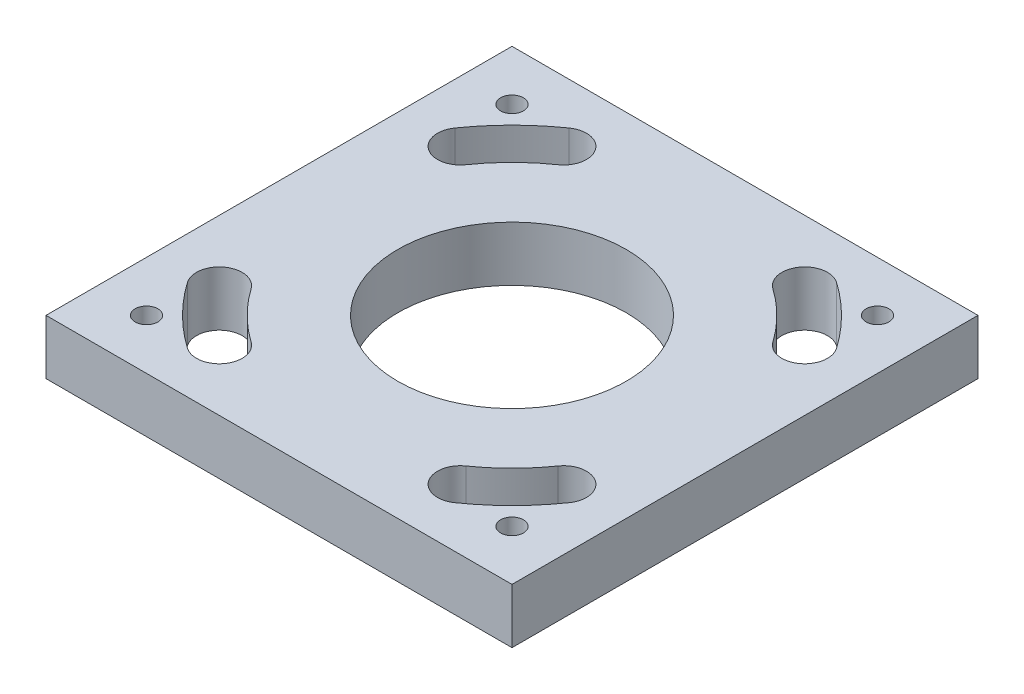
ISO-10303-21;
HEADER;
FILE_DESCRIPTION(('STEP AP214'),'2;1');
FILE_NAME('part.step','',(''),(''),'','','');
FILE_SCHEMA(('AUTOMOTIVE_DESIGN { 1 0 10303 214 1 1 1 1 }'));
ENDSEC;
DATA;
#1=APPLICATION_CONTEXT('core data for automotive mechanical design processes');
#2=APPLICATION_PROTOCOL_DEFINITION('international standard','automotive_design',2000,#1);
#3=PRODUCT_CONTEXT('',#1,'mechanical');
#4=PRODUCT('Part','Part','',(#3));
#5=PRODUCT_RELATED_PRODUCT_CATEGORY('part','',(#4));
#6=PRODUCT_DEFINITION_FORMATION('','',#4);
#7=PRODUCT_DEFINITION_CONTEXT('part definition',#1,'design');
#8=PRODUCT_DEFINITION('design','',#6,#7);
#9=PRODUCT_DEFINITION_SHAPE('','',#8);
#10=(LENGTH_UNIT() NAMED_UNIT(*) SI_UNIT(.MILLI.,.METRE.));
#11=(NAMED_UNIT(*) PLANE_ANGLE_UNIT() SI_UNIT($,.RADIAN.));
#12=(NAMED_UNIT(*) SI_UNIT($,.STERADIAN.) SOLID_ANGLE_UNIT());
#13=UNCERTAINTY_MEASURE_WITH_UNIT(LENGTH_MEASURE(1.E-05),#10,'distance_accuracy_value','');
#14=(GEOMETRIC_REPRESENTATION_CONTEXT(3) GLOBAL_UNCERTAINTY_ASSIGNED_CONTEXT((#13)) GLOBAL_UNIT_ASSIGNED_CONTEXT((#10,
#11,#12)) REPRESENTATION_CONTEXT('',''));
#15=CARTESIAN_POINT('',(0.,0.,0.));
#16=DIRECTION('',(0.,0.,1.));
#17=DIRECTION('',(1.,0.,0.));
#18=AXIS2_PLACEMENT_3D('',#15,#16,#17);
#19=CARTESIAN_POINT('',(0.,0.,0.));
#20=DIRECTION('',(0.,-1.,0.));
#21=DIRECTION('',(0.,0.,-1.));
#22=AXIS2_PLACEMENT_3D('',#19,#20,#21);
#23=PLANE('',#22);
#24=CARTESIAN_POINT('',(-63.5,0.,-63.5));
#25=DIRECTION('',(0.,1.,0.));
#26=DIRECTION('',(0.,0.,1.));
#27=AXIS2_PLACEMENT_3D('',#24,#25,#26);
#28=CIRCLE('',#27,3.96874999999999);
#29=CARTESIAN_POINT('',(-63.5,0.,-59.53125));
#30=VERTEX_POINT('',#29);
#31=EDGE_CURVE('E529',#30,#30,#28,.T.);
#32=ORIENTED_EDGE('',*,*,#31,.F.);
#33=EDGE_LOOP('',(#32));
#34=FACE_BOUND('',#33,.T.);
#35=CARTESIAN_POINT('',(63.5,0.,-63.5));
#36=DIRECTION('',(0.,1.,0.));
#37=DIRECTION('',(0.,0.,1.));
#38=AXIS2_PLACEMENT_3D('',#35,#36,#37);
#39=CIRCLE('',#38,3.96874999999999);
#40=CARTESIAN_POINT('',(63.5,0.,-59.53125));
#41=VERTEX_POINT('',#40);
#42=EDGE_CURVE('E533',#41,#41,#39,.T.);
#43=ORIENTED_EDGE('',*,*,#42,.F.);
#44=EDGE_LOOP('',(#43));
#45=FACE_BOUND('',#44,.T.);
#46=CARTESIAN_POINT('',(-63.5,0.,63.5));
#47=DIRECTION('',(0.,1.,0.));
#48=DIRECTION('',(0.,0.,1.));
#49=AXIS2_PLACEMENT_3D('',#46,#47,#48);
#50=CIRCLE('',#49,3.96874999999999);
#51=CARTESIAN_POINT('',(-63.5,0.,67.46875));
#52=VERTEX_POINT('',#51);
#53=EDGE_CURVE('E543',#52,#52,#50,.T.);
#54=ORIENTED_EDGE('',*,*,#53,.F.);
#55=EDGE_LOOP('',(#54));
#56=FACE_BOUND('',#55,.T.);
#57=CARTESIAN_POINT('',(0.,0.,0.));
#58=DIRECTION('',(0.,1.,0.));
#59=DIRECTION('',(0.,0.,1.));
#60=AXIS2_PLACEMENT_3D('',#57,#58,#59);
#61=CIRCLE('',#60,80.9625);
#62=CARTESIAN_POINT('',(-66.3205973857478,0.,46.438182228071));
#63=VERTEX_POINT('',#62);
#64=CARTESIAN_POINT('',(-46.4381822280725,0.,66.3205973857469));
#65=VERTEX_POINT('',#64);
#66=EDGE_CURVE('E217',#63,#65,#61,.T.);
#67=ORIENTED_EDGE('',*,*,#66,.F.);
#68=CARTESIAN_POINT('',(-59.818578034204,0.,41.8854192645347));
#69=DIRECTION('',(0.,1.,0.));
#70=DIRECTION('',(0.,0.,1.));
#71=AXIS2_PLACEMENT_3D('',#68,#69,#70);
#72=CIRCLE('',#71,7.93749999999999);
#73=CARTESIAN_POINT('',(-53.3165586826601,0.,37.3326563009983));
#74=VERTEX_POINT('',#73);
#75=EDGE_CURVE('E67',#74,#63,#72,.T.);
#76=ORIENTED_EDGE('',*,*,#75,.F.);
#77=CARTESIAN_POINT('',(0.,0.,0.));
#78=DIRECTION('',(0.,-1.,0.));
#79=DIRECTION('',(0.,0.,1.));
#80=AXIS2_PLACEMENT_3D('',#77,#78,#79);
#81=CIRCLE('',#80,65.0875);
#82=CARTESIAN_POINT('',(-37.3326563009994,0.,53.3165586826593));
#83=VERTEX_POINT('',#82);
#84=EDGE_CURVE('E201',#83,#74,#81,.T.);
#85=ORIENTED_EDGE('',*,*,#84,.F.);
#86=CARTESIAN_POINT('',(-41.885419264536,0.,59.8185780342031));
#87=DIRECTION('',(0.,1.,0.));
#88=DIRECTION('',(0.,0.,1.));
#89=AXIS2_PLACEMENT_3D('',#86,#87,#88);
#90=CIRCLE('',#89,7.93749999999999);
#91=EDGE_CURVE('E205',#65,#83,#90,.T.);
#92=ORIENTED_EDGE('',*,*,#91,.F.);
#93=EDGE_LOOP('',(#67,#76,#85,#92));
#94=FACE_BOUND('',#93,.T.);
#95=CARTESIAN_POINT('',(0.,0.,0.));
#96=DIRECTION('',(0.,1.,0.));
#97=DIRECTION('',(0.,0.,1.));
#98=AXIS2_PLACEMENT_3D('',#95,#96,#97);
#99=CIRCLE('',#98,80.9625);
#100=CARTESIAN_POINT('',(46.4381822280713,0.,66.3205973857477));
#101=VERTEX_POINT('',#100);
#102=CARTESIAN_POINT('',(66.320597385747,0.,46.4381822280722));
#103=VERTEX_POINT('',#102);
#104=EDGE_CURVE('E252',#101,#103,#99,.T.);
#105=ORIENTED_EDGE('',*,*,#104,.F.);
#106=CARTESIAN_POINT('',(41.8854192645349,0.,59.8185780342038));
#107=DIRECTION('',(0.,1.,0.));
#108=DIRECTION('',(0.,0.,1.));
#109=AXIS2_PLACEMENT_3D('',#106,#107,#108);
#110=CIRCLE('',#109,7.93749999999998);
#111=CARTESIAN_POINT('',(37.3326563009985,0.,53.3165586826599));
#112=VERTEX_POINT('',#111);
#113=EDGE_CURVE('E226',#112,#101,#110,.T.);
#114=ORIENTED_EDGE('',*,*,#113,.F.);
#115=CARTESIAN_POINT('',(0.,0.,0.));
#116=DIRECTION('',(0.,-1.,0.));
#117=DIRECTION('',(0.,0.,1.));
#118=AXIS2_PLACEMENT_3D('',#115,#116,#117);
#119=CIRCLE('',#118,65.0875);
#120=CARTESIAN_POINT('',(53.3165586826594,0.,37.3326563009992));
#121=VERTEX_POINT('',#120);
#122=EDGE_CURVE('E237',#121,#112,#119,.T.);
#123=ORIENTED_EDGE('',*,*,#122,.F.);
#124=CARTESIAN_POINT('',(59.8185780342032,0.,41.8854192645357));
#125=DIRECTION('',(0.,1.,0.));
#126=DIRECTION('',(0.,0.,1.));
#127=AXIS2_PLACEMENT_3D('',#124,#125,#126);
#128=CIRCLE('',#127,7.93749999999999);
#129=EDGE_CURVE('E256',#103,#121,#128,.T.);
#130=ORIENTED_EDGE('',*,*,#129,.F.);
#131=EDGE_LOOP('',(#105,#114,#123,#130));
#132=FACE_BOUND('',#131,.T.);
#133=CARTESIAN_POINT('',(0.,0.,0.));
#134=DIRECTION('',(0.,1.,0.));
#135=DIRECTION('',(0.,0.,1.));
#136=AXIS2_PLACEMENT_3D('',#133,#134,#135);
#137=CIRCLE('',#136,80.9625);
#138=CARTESIAN_POINT('',(66.3205973857475,0.,-46.4381822280715));
#139=VERTEX_POINT('',#138);
#140=CARTESIAN_POINT('',(46.438182228072,0.,-66.3205973857472));
#141=VERTEX_POINT('',#140);
#142=EDGE_CURVE('E296',#139,#141,#137,.T.);
#143=ORIENTED_EDGE('',*,*,#142,.F.);
#144=CARTESIAN_POINT('',(59.8185780342036,0.,-41.8854192645351));
#145=DIRECTION('',(0.,1.,0.));
#146=DIRECTION('',(0.,0.,1.));
#147=AXIS2_PLACEMENT_3D('',#144,#145,#146);
#148=CIRCLE('',#147,7.93749999999999);
#149=CARTESIAN_POINT('',(53.3165586826598,0.,-37.3326563009987));
#150=VERTEX_POINT('',#149);
#151=EDGE_CURVE('E266',#150,#139,#148,.T.);
#152=ORIENTED_EDGE('',*,*,#151,.F.);
#153=CARTESIAN_POINT('',(0.,0.,0.));
#154=DIRECTION('',(0.,-1.,0.));
#155=DIRECTION('',(0.,0.,1.));
#156=AXIS2_PLACEMENT_3D('',#153,#154,#155);
#157=CIRCLE('',#156,65.0875);
#158=CARTESIAN_POINT('',(37.3326563009991,0.,-53.3165586826595));
#159=VERTEX_POINT('',#158);
#160=EDGE_CURVE('E281',#159,#150,#157,.T.);
#161=ORIENTED_EDGE('',*,*,#160,.F.);
#162=CARTESIAN_POINT('',(41.8854192645355,0.,-59.8185780342034));
#163=DIRECTION('',(0.,1.,0.));
#164=DIRECTION('',(0.,0.,1.));
#165=AXIS2_PLACEMENT_3D('',#162,#163,#164);
#166=CIRCLE('',#165,7.93749999999998);
#167=EDGE_CURVE('E300',#141,#159,#166,.T.);
#168=ORIENTED_EDGE('',*,*,#167,.F.);
#169=EDGE_LOOP('',(#143,#152,#161,#168));
#170=FACE_BOUND('',#169,.T.);
#171=CARTESIAN_POINT('',(0.,0.,0.));
#172=DIRECTION('',(0.,1.,0.));
#173=DIRECTION('',(0.,0.,1.));
#174=AXIS2_PLACEMENT_3D('',#171,#172,#173);
#175=CIRCLE('',#174,80.9625);
#176=CARTESIAN_POINT('',(-46.4381822280717,0.,-66.3205973857474));
#177=VERTEX_POINT('',#176);
#178=CARTESIAN_POINT('',(-66.3205973857473,0.,-46.4381822280718));
#179=VERTEX_POINT('',#178);
#180=EDGE_CURVE('E340',#177,#179,#175,.T.);
#181=ORIENTED_EDGE('',*,*,#180,.F.);
#182=CARTESIAN_POINT('',(-41.8854192645353,0.,-59.8185780342035));
#183=DIRECTION('',(0.,1.,0.));
#184=DIRECTION('',(0.,0.,1.));
#185=AXIS2_PLACEMENT_3D('',#182,#183,#184);
#186=CIRCLE('',#185,7.93749999999998);
#187=CARTESIAN_POINT('',(-37.3326563009988,0.,-53.3165586826597));
#188=VERTEX_POINT('',#187);
#189=EDGE_CURVE('E310',#188,#177,#186,.T.);
#190=ORIENTED_EDGE('',*,*,#189,.F.);
#191=CARTESIAN_POINT('',(0.,0.,0.));
#192=DIRECTION('',(0.,-1.,0.));
#193=DIRECTION('',(0.,0.,1.));
#194=AXIS2_PLACEMENT_3D('',#191,#192,#193);
#195=CIRCLE('',#194,65.0875);
#196=CARTESIAN_POINT('',(-53.3165586826596,0.,-37.3326563009989));
#197=VERTEX_POINT('',#196);
#198=EDGE_CURVE('E325',#197,#188,#195,.T.);
#199=ORIENTED_EDGE('',*,*,#198,.F.);
#200=CARTESIAN_POINT('',(-59.8185780342035,0.,-41.8854192645353));
#201=DIRECTION('',(0.,1.,0.));
#202=DIRECTION('',(0.,0.,1.));
#203=AXIS2_PLACEMENT_3D('',#200,#201,#202);
#204=CIRCLE('',#203,7.93749999999999);
#205=EDGE_CURVE('E344',#179,#197,#204,.T.);
#206=ORIENTED_EDGE('',*,*,#205,.F.);
#207=EDGE_LOOP('',(#181,#190,#199,#206));
#208=FACE_BOUND('',#207,.T.);
#209=CARTESIAN_POINT('',(0.,0.,0.));
#210=DIRECTION('',(0.,1.,0.));
#211=DIRECTION('',(0.,0.,1.));
#212=AXIS2_PLACEMENT_3D('',#209,#210,#211);
#213=CIRCLE('',#212,39.6875);
#214=CARTESIAN_POINT('',(0.,0.,39.6875));
#215=VERTEX_POINT('',#214);
#216=EDGE_CURVE('E354',#215,#215,#213,.T.);
#217=ORIENTED_EDGE('',*,*,#216,.F.);
#218=EDGE_LOOP('',(#217));
#219=FACE_BOUND('',#218,.T.);
#220=DIRECTION('',(0.,0.,-1.));
#221=VECTOR('',#220,1.);
#222=CARTESIAN_POINT('',(80.9625,0.,80.9625));
#223=LINE('',#222,#221);
#224=CARTESIAN_POINT('',(80.9625,0.,80.9625));
#225=VERTEX_POINT('',#224);
#226=CARTESIAN_POINT('',(80.9625,0.,-80.9625));
#227=VERTEX_POINT('',#226);
#228=EDGE_CURVE('E368',#225,#227,#223,.T.);
#229=ORIENTED_EDGE('',*,*,#228,.T.);
#230=DIRECTION('',(-1.,0.,0.));
#231=VECTOR('',#230,1.);
#232=CARTESIAN_POINT('',(-80.9625,0.,-80.9625));
#233=LINE('',#232,#231);
#234=CARTESIAN_POINT('',(-80.9625,0.,-80.9625));
#235=VERTEX_POINT('',#234);
#236=EDGE_CURVE('E392',#227,#235,#233,.T.);
#237=ORIENTED_EDGE('',*,*,#236,.T.);
#238=DIRECTION('',(0.,0.,1.));
#239=VECTOR('',#238,1.);
#240=CARTESIAN_POINT('',(-80.9625,0.,80.9625));
#241=LINE('',#240,#239);
#242=CARTESIAN_POINT('',(-80.9625,0.,80.9625));
#243=VERTEX_POINT('',#242);
#244=EDGE_CURVE('E396',#235,#243,#241,.T.);
#245=ORIENTED_EDGE('',*,*,#244,.T.);
#246=DIRECTION('',(1.,0.,0.));
#247=VECTOR('',#246,1.);
#248=CARTESIAN_POINT('',(-80.9625,0.,80.9625));
#249=LINE('',#248,#247);
#250=EDGE_CURVE('E377',#243,#225,#249,.T.);
#251=ORIENTED_EDGE('',*,*,#250,.T.);
#252=EDGE_LOOP('',(#229,#237,#245,#251));
#253=FACE_BOUND('',#252,.T.);
#254=CARTESIAN_POINT('',(63.5,0.,63.5));
#255=DIRECTION('',(0.,1.,0.));
#256=DIRECTION('',(0.,0.,1.));
#257=AXIS2_PLACEMENT_3D('',#254,#255,#256);
#258=CIRCLE('',#257,3.96874999999999);
#259=CARTESIAN_POINT('',(63.5,0.,67.46875));
#260=VERTEX_POINT('',#259);
#261=EDGE_CURVE('E550',#260,#260,#258,.T.);
#262=ORIENTED_EDGE('',*,*,#261,.F.);
#263=EDGE_LOOP('',(#262));
#264=FACE_BOUND('',#263,.T.);
#265=ADVANCED_FACE('F41',(#34,#45,#56,#94,#132,#170,#208,#219,#253,#264),#23,.F.);
#266=CARTESIAN_POINT('',(80.9625,-19.05,80.9625));
#267=DIRECTION('',(1.,0.,0.));
#268=DIRECTION('',(0.,0.,-1.));
#269=AXIS2_PLACEMENT_3D('',#266,#267,#268);
#270=PLANE('',#269);
#271=ORIENTED_EDGE('',*,*,#228,.F.);
#272=DIRECTION('',(0.,1.,0.));
#273=VECTOR('',#272,1.);
#274=CARTESIAN_POINT('',(80.9625,-19.05,80.9625));
#275=LINE('',#274,#273);
#276=CARTESIAN_POINT('',(80.9625,-19.05,80.9625));
#277=VERTEX_POINT('',#276);
#278=EDGE_CURVE('E11',#277,#225,#275,.T.);
#279=ORIENTED_EDGE('',*,*,#278,.F.);
#280=DIRECTION('',(0.,0.,-1.));
#281=VECTOR('',#280,1.);
#282=CARTESIAN_POINT('',(80.9625,-19.05,80.9625));
#283=LINE('',#282,#281);
#284=CARTESIAN_POINT('',(80.9625,-19.05,-80.9625));
#285=VERTEX_POINT('',#284);
#286=EDGE_CURVE('E372',#277,#285,#283,.T.);
#287=ORIENTED_EDGE('',*,*,#286,.T.);
#288=DIRECTION('',(0.,1.,0.));
#289=VECTOR('',#288,1.);
#290=CARTESIAN_POINT('',(80.9625,-19.05,-80.9625));
#291=LINE('',#290,#289);
#292=EDGE_CURVE('E45',#285,#227,#291,.T.);
#293=ORIENTED_EDGE('',*,*,#292,.T.);
#294=EDGE_LOOP('',(#271,#279,#287,#293));
#295=FACE_BOUND('',#294,.T.);
#296=ADVANCED_FACE('F43',(#295),#270,.T.);
#297=CARTESIAN_POINT('',(-80.9625,-19.05,80.9625));
#298=DIRECTION('',(0.,0.,1.));
#299=DIRECTION('',(1.,0.,0.));
#300=AXIS2_PLACEMENT_3D('',#297,#298,#299);
#301=PLANE('',#300);
#302=ORIENTED_EDGE('',*,*,#250,.F.);
#303=DIRECTION('',(0.,1.,0.));
#304=VECTOR('',#303,1.);
#305=CARTESIAN_POINT('',(-80.9625,-19.05,80.9625));
#306=LINE('',#305,#304);
#307=CARTESIAN_POINT('',(-80.9625,-19.05,80.9625));
#308=VERTEX_POINT('',#307);
#309=EDGE_CURVE('E51',#308,#243,#306,.T.);
#310=ORIENTED_EDGE('',*,*,#309,.F.);
#311=DIRECTION('',(1.,0.,0.));
#312=VECTOR('',#311,1.);
#313=CARTESIAN_POINT('',(-80.9625,-19.05,80.9625));
#314=LINE('',#313,#312);
#315=EDGE_CURVE('E385',#308,#277,#314,.T.);
#316=ORIENTED_EDGE('',*,*,#315,.T.);
#317=ORIENTED_EDGE('',*,*,#278,.T.);
#318=EDGE_LOOP('',(#302,#310,#316,#317));
#319=FACE_BOUND('',#318,.T.);
#320=ADVANCED_FACE('F419',(#319),#301,.T.);
#321=CARTESIAN_POINT('',(-80.9625,-19.05,80.9625));
#322=DIRECTION('',(-1.,0.,0.));
#323=DIRECTION('',(0.,0.,1.));
#324=AXIS2_PLACEMENT_3D('',#321,#322,#323);
#325=PLANE('',#324);
#326=ORIENTED_EDGE('',*,*,#244,.F.);
#327=DIRECTION('',(0.,1.,0.));
#328=VECTOR('',#327,1.);
#329=CARTESIAN_POINT('',(-80.9625,-19.05,-80.9625));
#330=LINE('',#329,#328);
#331=CARTESIAN_POINT('',(-80.9625,-19.05,-80.9625));
#332=VERTEX_POINT('',#331);
#333=EDGE_CURVE('E404',#332,#235,#330,.T.);
#334=ORIENTED_EDGE('',*,*,#333,.F.);
#335=DIRECTION('',(0.,0.,1.));
#336=VECTOR('',#335,1.);
#337=CARTESIAN_POINT('',(-80.9625,-19.05,80.9625));
#338=LINE('',#337,#336);
#339=EDGE_CURVE('E381',#332,#308,#338,.T.);
#340=ORIENTED_EDGE('',*,*,#339,.T.);
#341=ORIENTED_EDGE('',*,*,#309,.T.);
#342=EDGE_LOOP('',(#326,#334,#340,#341));
#343=FACE_BOUND('',#342,.T.);
#344=ADVANCED_FACE('F424',(#343),#325,.T.);
#345=CARTESIAN_POINT('',(-80.9625,-19.05,-80.9625));
#346=DIRECTION('',(0.,0.,-1.));
#347=DIRECTION('',(-1.,0.,0.));
#348=AXIS2_PLACEMENT_3D('',#345,#346,#347);
#349=PLANE('',#348);
#350=ORIENTED_EDGE('',*,*,#236,.F.);
#351=ORIENTED_EDGE('',*,*,#292,.F.);
#352=DIRECTION('',(-1.,0.,0.));
#353=VECTOR('',#352,1.);
#354=CARTESIAN_POINT('',(-80.9625,-19.05,-80.9625));
#355=LINE('',#354,#353);
#356=EDGE_CURVE('E376',#285,#332,#355,.T.);
#357=ORIENTED_EDGE('',*,*,#356,.T.);
#358=ORIENTED_EDGE('',*,*,#333,.T.);
#359=EDGE_LOOP('',(#350,#351,#357,#358));
#360=FACE_BOUND('',#359,.T.);
#361=ADVANCED_FACE('F414',(#360),#349,.T.);
#362=CARTESIAN_POINT('',(0.,-19.05,0.));
#363=DIRECTION('',(0.,-1.,0.));
#364=DIRECTION('',(0.,0.,-1.));
#365=AXIS2_PLACEMENT_3D('',#362,#363,#364);
#366=PLANE('',#365);
#367=CARTESIAN_POINT('',(-63.5,-19.05,-63.5));
#368=DIRECTION('',(0.,1.,0.));
#369=DIRECTION('',(0.,0.,1.));
#370=AXIS2_PLACEMENT_3D('',#367,#368,#369);
#371=CIRCLE('',#370,3.96875);
#372=CARTESIAN_POINT('',(-63.5,-19.05,-59.53125));
#373=VERTEX_POINT('',#372);
#374=EDGE_CURVE('E527',#373,#373,#371,.T.);
#375=ORIENTED_EDGE('',*,*,#374,.T.);
#376=EDGE_LOOP('',(#375));
#377=FACE_BOUND('',#376,.T.);
#378=CARTESIAN_POINT('',(63.5,-19.05,-63.5));
#379=DIRECTION('',(0.,1.,0.));
#380=DIRECTION('',(0.,0.,1.));
#381=AXIS2_PLACEMENT_3D('',#378,#379,#380);
#382=CIRCLE('',#381,3.96874999999999);
#383=CARTESIAN_POINT('',(63.5,-19.05,-59.53125));
#384=VERTEX_POINT('',#383);
#385=EDGE_CURVE('E539',#384,#384,#382,.T.);
#386=ORIENTED_EDGE('',*,*,#385,.T.);
#387=EDGE_LOOP('',(#386));
#388=FACE_BOUND('',#387,.T.);
#389=CARTESIAN_POINT('',(-63.5,-19.05,63.5));
#390=DIRECTION('',(0.,1.,0.));
#391=DIRECTION('',(0.,0.,1.));
#392=AXIS2_PLACEMENT_3D('',#389,#390,#391);
#393=CIRCLE('',#392,3.96875);
#394=CARTESIAN_POINT('',(-63.5,-19.05,67.46875));
#395=VERTEX_POINT('',#394);
#396=EDGE_CURVE('E547',#395,#395,#393,.T.);
#397=ORIENTED_EDGE('',*,*,#396,.T.);
#398=EDGE_LOOP('',(#397));
#399=FACE_BOUND('',#398,.T.);
#400=CARTESIAN_POINT('',(63.5,-19.05,63.5));
#401=DIRECTION('',(0.,1.,0.));
#402=DIRECTION('',(0.,0.,1.));
#403=AXIS2_PLACEMENT_3D('',#400,#401,#402);
#404=CIRCLE('',#403,3.96874999999999);
#405=CARTESIAN_POINT('',(63.5,-19.05,67.46875));
#406=VERTEX_POINT('',#405);
#407=EDGE_CURVE('E208',#406,#406,#404,.T.);
#408=ORIENTED_EDGE('',*,*,#407,.T.);
#409=EDGE_LOOP('',(#408));
#410=FACE_BOUND('',#409,.T.);
#411=CARTESIAN_POINT('',(-59.818578034204,-19.05,41.8854192645347));
#412=DIRECTION('',(0.,1.,0.));
#413=DIRECTION('',(0.,0.,1.));
#414=AXIS2_PLACEMENT_3D('',#411,#412,#413);
#415=CIRCLE('',#414,7.93749999999999);
#416=CARTESIAN_POINT('',(-53.3165586826601,-19.05,37.3326563009983));
#417=VERTEX_POINT('',#416);
#418=CARTESIAN_POINT('',(-66.3205973857478,-19.05,46.438182228071));
#419=VERTEX_POINT('',#418);
#420=EDGE_CURVE('E182',#417,#419,#415,.T.);
#421=ORIENTED_EDGE('',*,*,#420,.T.);
#422=CARTESIAN_POINT('',(0.,-19.05,0.));
#423=DIRECTION('',(0.,1.,0.));
#424=DIRECTION('',(0.,0.,1.));
#425=AXIS2_PLACEMENT_3D('',#422,#423,#424);
#426=CIRCLE('',#425,80.9625);
#427=CARTESIAN_POINT('',(-46.4381822280725,-19.05,66.3205973857469));
#428=VERTEX_POINT('',#427);
#429=EDGE_CURVE('E192',#419,#428,#426,.T.);
#430=ORIENTED_EDGE('',*,*,#429,.T.);
#431=CARTESIAN_POINT('',(-41.885419264536,-19.05,59.8185780342031));
#432=DIRECTION('',(0.,1.,0.));
#433=DIRECTION('',(0.,0.,1.));
#434=AXIS2_PLACEMENT_3D('',#431,#432,#433);
#435=CIRCLE('',#434,7.93749999999999);
#436=CARTESIAN_POINT('',(-37.3326563009994,-19.05,53.3165586826593));
#437=VERTEX_POINT('',#436);
#438=EDGE_CURVE('E59',#428,#437,#435,.T.);
#439=ORIENTED_EDGE('',*,*,#438,.T.);
#440=CARTESIAN_POINT('',(0.,-19.05,0.));
#441=DIRECTION('',(0.,-1.,0.));
#442=DIRECTION('',(0.,0.,1.));
#443=AXIS2_PLACEMENT_3D('',#440,#441,#442);
#444=CIRCLE('',#443,65.0875);
#445=EDGE_CURVE('E189',#437,#417,#444,.T.);
#446=ORIENTED_EDGE('',*,*,#445,.T.);
#447=EDGE_LOOP('',(#421,#430,#439,#446));
#448=FACE_BOUND('',#447,.T.);
#449=CARTESIAN_POINT('',(41.8854192645349,-19.05,59.8185780342038));
#450=DIRECTION('',(0.,1.,0.));
#451=DIRECTION('',(0.,0.,1.));
#452=AXIS2_PLACEMENT_3D('',#449,#450,#451);
#453=CIRCLE('',#452,7.93749999999998);
#454=CARTESIAN_POINT('',(37.3326563009985,-19.05,53.3165586826599));
#455=VERTEX_POINT('',#454);
#456=CARTESIAN_POINT('',(46.4381822280713,-19.05,66.3205973857477));
#457=VERTEX_POINT('',#456);
#458=EDGE_CURVE('E232',#455,#457,#453,.T.);
#459=ORIENTED_EDGE('',*,*,#458,.T.);
#460=CARTESIAN_POINT('',(0.,-19.05,0.));
#461=DIRECTION('',(0.,1.,0.));
#462=DIRECTION('',(0.,0.,1.));
#463=AXIS2_PLACEMENT_3D('',#460,#461,#462);
#464=CIRCLE('',#463,80.9625);
#465=CARTESIAN_POINT('',(66.320597385747,-19.05,46.4381822280722));
#466=VERTEX_POINT('',#465);
#467=EDGE_CURVE('E236',#457,#466,#464,.T.);
#468=ORIENTED_EDGE('',*,*,#467,.T.);
#469=CARTESIAN_POINT('',(59.8185780342032,-19.05,41.8854192645357));
#470=DIRECTION('',(0.,1.,0.));
#471=DIRECTION('',(0.,0.,1.));
#472=AXIS2_PLACEMENT_3D('',#469,#470,#471);
#473=CIRCLE('',#472,7.93749999999999);
#474=CARTESIAN_POINT('',(53.3165586826594,-19.05,37.3326563009992));
#475=VERTEX_POINT('',#474);
#476=EDGE_CURVE('E241',#466,#475,#473,.T.);
#477=ORIENTED_EDGE('',*,*,#476,.T.);
#478=CARTESIAN_POINT('',(0.,-19.05,0.));
#479=DIRECTION('',(0.,-1.,0.));
#480=DIRECTION('',(0.,0.,1.));
#481=AXIS2_PLACEMENT_3D('',#478,#479,#480);
#482=CIRCLE('',#481,65.0875);
#483=EDGE_CURVE('E245',#475,#455,#482,.T.);
#484=ORIENTED_EDGE('',*,*,#483,.T.);
#485=EDGE_LOOP('',(#459,#468,#477,#484));
#486=FACE_BOUND('',#485,.T.);
#487=CARTESIAN_POINT('',(59.8185780342036,-19.05,-41.8854192645351));
#488=DIRECTION('',(0.,1.,0.));
#489=DIRECTION('',(0.,0.,1.));
#490=AXIS2_PLACEMENT_3D('',#487,#488,#489);
#491=CIRCLE('',#490,7.93749999999999);
#492=CARTESIAN_POINT('',(53.3165586826598,-19.05,-37.3326563009987));
#493=VERTEX_POINT('',#492);
#494=CARTESIAN_POINT('',(66.3205973857475,-19.05,-46.4381822280715));
#495=VERTEX_POINT('',#494);
#496=EDGE_CURVE('E276',#493,#495,#491,.T.);
#497=ORIENTED_EDGE('',*,*,#496,.T.);
#498=CARTESIAN_POINT('',(0.,-19.05,0.));
#499=DIRECTION('',(0.,1.,0.));
#500=DIRECTION('',(0.,0.,1.));
#501=AXIS2_PLACEMENT_3D('',#498,#499,#500);
#502=CIRCLE('',#501,80.9625);
#503=CARTESIAN_POINT('',(46.438182228072,-19.05,-66.3205973857472));
#504=VERTEX_POINT('',#503);
#505=EDGE_CURVE('E280',#495,#504,#502,.T.);
#506=ORIENTED_EDGE('',*,*,#505,.T.);
#507=CARTESIAN_POINT('',(41.8854192645355,-19.05,-59.8185780342034));
#508=DIRECTION('',(0.,1.,0.));
#509=DIRECTION('',(0.,0.,1.));
#510=AXIS2_PLACEMENT_3D('',#507,#508,#509);
#511=CIRCLE('',#510,7.93749999999998);
#512=CARTESIAN_POINT('',(37.3326563009991,-19.05,-53.3165586826595));
#513=VERTEX_POINT('',#512);
#514=EDGE_CURVE('E285',#504,#513,#511,.T.);
#515=ORIENTED_EDGE('',*,*,#514,.T.);
#516=CARTESIAN_POINT('',(0.,-19.05,0.));
#517=DIRECTION('',(0.,-1.,0.));
#518=DIRECTION('',(0.,0.,1.));
#519=AXIS2_PLACEMENT_3D('',#516,#517,#518);
#520=CIRCLE('',#519,65.0875);
#521=EDGE_CURVE('E289',#513,#493,#520,.T.);
#522=ORIENTED_EDGE('',*,*,#521,.T.);
#523=EDGE_LOOP('',(#497,#506,#515,#522));
#524=FACE_BOUND('',#523,.T.);
#525=CARTESIAN_POINT('',(-41.8854192645353,-19.05,-59.8185780342035));
#526=DIRECTION('',(0.,1.,0.));
#527=DIRECTION('',(0.,0.,1.));
#528=AXIS2_PLACEMENT_3D('',#525,#526,#527);
#529=CIRCLE('',#528,7.93749999999998);
#530=CARTESIAN_POINT('',(-37.3326563009988,-19.05,-53.3165586826597));
#531=VERTEX_POINT('',#530);
#532=CARTESIAN_POINT('',(-46.4381822280717,-19.05,-66.3205973857474));
#533=VERTEX_POINT('',#532);
#534=EDGE_CURVE('E320',#531,#533,#529,.T.);
#535=ORIENTED_EDGE('',*,*,#534,.T.);
#536=CARTESIAN_POINT('',(0.,-19.05,0.));
#537=DIRECTION('',(0.,1.,0.));
#538=DIRECTION('',(0.,0.,1.));
#539=AXIS2_PLACEMENT_3D('',#536,#537,#538);
#540=CIRCLE('',#539,80.9625);
#541=CARTESIAN_POINT('',(-66.3205973857473,-19.05,-46.4381822280718));
#542=VERTEX_POINT('',#541);
#543=EDGE_CURVE('E324',#533,#542,#540,.T.);
#544=ORIENTED_EDGE('',*,*,#543,.T.);
#545=CARTESIAN_POINT('',(-59.8185780342035,-19.05,-41.8854192645353));
#546=DIRECTION('',(0.,1.,0.));
#547=DIRECTION('',(0.,0.,1.));
#548=AXIS2_PLACEMENT_3D('',#545,#546,#547);
#549=CIRCLE('',#548,7.93749999999999);
#550=CARTESIAN_POINT('',(-53.3165586826596,-19.05,-37.3326563009989));
#551=VERTEX_POINT('',#550);
#552=EDGE_CURVE('E329',#542,#551,#549,.T.);
#553=ORIENTED_EDGE('',*,*,#552,.T.);
#554=CARTESIAN_POINT('',(0.,-19.05,0.));
#555=DIRECTION('',(0.,-1.,0.));
#556=DIRECTION('',(0.,0.,1.));
#557=AXIS2_PLACEMENT_3D('',#554,#555,#556);
#558=CIRCLE('',#557,65.0875);
#559=EDGE_CURVE('E333',#551,#531,#558,.T.);
#560=ORIENTED_EDGE('',*,*,#559,.T.);
#561=EDGE_LOOP('',(#535,#544,#553,#560));
#562=FACE_BOUND('',#561,.T.);
#563=CARTESIAN_POINT('',(0.,-19.05,0.));
#564=DIRECTION('',(0.,1.,0.));
#565=DIRECTION('',(0.,0.,1.));
#566=AXIS2_PLACEMENT_3D('',#563,#564,#565);
#567=CIRCLE('',#566,39.6875);
#568=CARTESIAN_POINT('',(0.,-19.05,39.6875));
#569=VERTEX_POINT('',#568);
#570=EDGE_CURVE('E364',#569,#569,#567,.T.);
#571=ORIENTED_EDGE('',*,*,#570,.T.);
#572=EDGE_LOOP('',(#571));
#573=FACE_BOUND('',#572,.T.);
#574=ORIENTED_EDGE('',*,*,#286,.F.);
#575=ORIENTED_EDGE('',*,*,#315,.F.);
#576=ORIENTED_EDGE('',*,*,#339,.F.);
#577=ORIENTED_EDGE('',*,*,#356,.F.);
#578=EDGE_LOOP('',(#574,#575,#576,#577));
#579=FACE_BOUND('',#578,.T.);
#580=ADVANCED_FACE('F197',(#377,#388,#399,#410,#448,#486,#524,#562,#573,#579),#366,.T.);
#581=CARTESIAN_POINT('',(0.,-19.05,0.));
#582=DIRECTION('',(0.,1.,0.));
#583=DIRECTION('',(0.,0.,1.));
#584=AXIS2_PLACEMENT_3D('',#581,#582,#583);
#585=CYLINDRICAL_SURFACE('',#584,39.6875);
#586=ORIENTED_EDGE('',*,*,#570,.F.);
#587=EDGE_LOOP('',(#586));
#588=FACE_BOUND('',#587,.T.);
#589=ORIENTED_EDGE('',*,*,#216,.T.);
#590=EDGE_LOOP('',(#589));
#591=FACE_BOUND('',#590,.T.);
#592=ADVANCED_FACE('F443',(#588,#591),#585,.F.);
#593=CARTESIAN_POINT('',(-41.8854192645353,-19.05,-59.8185780342035));
#594=DIRECTION('',(0.,1.,0.));
#595=DIRECTION('',(0.,0.,1.));
#596=AXIS2_PLACEMENT_3D('',#593,#594,#595);
#597=CYLINDRICAL_SURFACE('',#596,7.93749999999998);
#598=ORIENTED_EDGE('',*,*,#189,.T.);
#599=DIRECTION('',(0.,1.,0.));
#600=VECTOR('',#599,1.);
#601=CARTESIAN_POINT('',(-46.4381822280717,-19.05,-66.3205973857474));
#602=LINE('',#601,#600);
#603=EDGE_CURVE('E337',#533,#177,#602,.T.);
#604=ORIENTED_EDGE('',*,*,#603,.F.);
#605=ORIENTED_EDGE('',*,*,#534,.F.);
#606=DIRECTION('',(0.,1.,0.));
#607=VECTOR('',#606,1.);
#608=CARTESIAN_POINT('',(-37.3326563009988,-19.05,-53.3165586826597));
#609=LINE('',#608,#607);
#610=EDGE_CURVE('E351',#531,#188,#609,.T.);
#611=ORIENTED_EDGE('',*,*,#610,.T.);
#612=EDGE_LOOP('',(#598,#604,#605,#611));
#613=FACE_BOUND('',#612,.T.);
#614=ADVANCED_FACE('F447',(#613),#597,.F.);
#615=CARTESIAN_POINT('',(0.,-19.05,0.));
#616=DIRECTION('',(0.,1.,0.));
#617=DIRECTION('',(0.,0.,1.));
#618=AXIS2_PLACEMENT_3D('',#615,#616,#617);
#619=CYLINDRICAL_SURFACE('',#618,65.0875);
#620=ORIENTED_EDGE('',*,*,#198,.T.);
#621=ORIENTED_EDGE('',*,*,#610,.F.);
#622=ORIENTED_EDGE('',*,*,#559,.F.);
#623=DIRECTION('',(0.,1.,0.));
#624=VECTOR('',#623,1.);
#625=CARTESIAN_POINT('',(-53.3165586826596,-19.05,-37.3326563009989));
#626=LINE('',#625,#624);
#627=EDGE_CURVE('E355',#551,#197,#626,.T.);
#628=ORIENTED_EDGE('',*,*,#627,.T.);
#629=EDGE_LOOP('',(#620,#621,#622,#628));
#630=FACE_BOUND('',#629,.T.);
#631=ADVANCED_FACE('F451',(#630),#619,.T.);
#632=CARTESIAN_POINT('',(-59.8185780342035,-19.05,-41.8854192645353));
#633=DIRECTION('',(0.,1.,0.));
#634=DIRECTION('',(0.,0.,1.));
#635=AXIS2_PLACEMENT_3D('',#632,#633,#634);
#636=CYLINDRICAL_SURFACE('',#635,7.93749999999999);
#637=ORIENTED_EDGE('',*,*,#205,.T.);
#638=ORIENTED_EDGE('',*,*,#627,.F.);
#639=ORIENTED_EDGE('',*,*,#552,.F.);
#640=DIRECTION('',(0.,1.,0.));
#641=VECTOR('',#640,1.);
#642=CARTESIAN_POINT('',(-66.3205973857473,-19.05,-46.4381822280718));
#643=LINE('',#642,#641);
#644=EDGE_CURVE('E358',#542,#179,#643,.T.);
#645=ORIENTED_EDGE('',*,*,#644,.T.);
#646=EDGE_LOOP('',(#637,#638,#639,#645));
#647=FACE_BOUND('',#646,.T.);
#648=ADVANCED_FACE('F457',(#647),#636,.F.);
#649=CARTESIAN_POINT('',(0.,-19.05,0.));
#650=DIRECTION('',(0.,1.,0.));
#651=DIRECTION('',(0.,0.,1.));
#652=AXIS2_PLACEMENT_3D('',#649,#650,#651);
#653=CYLINDRICAL_SURFACE('',#652,80.9625);
#654=ORIENTED_EDGE('',*,*,#180,.T.);
#655=ORIENTED_EDGE('',*,*,#644,.F.);
#656=ORIENTED_EDGE('',*,*,#543,.F.);
#657=ORIENTED_EDGE('',*,*,#603,.T.);
#658=EDGE_LOOP('',(#654,#655,#656,#657));
#659=FACE_BOUND('',#658,.T.);
#660=ADVANCED_FACE('F453',(#659),#653,.F.);
#661=CARTESIAN_POINT('',(59.8185780342036,-19.05,-41.8854192645351));
#662=DIRECTION('',(0.,1.,0.));
#663=DIRECTION('',(0.,0.,1.));
#664=AXIS2_PLACEMENT_3D('',#661,#662,#663);
#665=CYLINDRICAL_SURFACE('',#664,7.93749999999999);
#666=ORIENTED_EDGE('',*,*,#151,.T.);
#667=DIRECTION('',(0.,1.,0.));
#668=VECTOR('',#667,1.);
#669=CARTESIAN_POINT('',(66.3205973857475,-19.05,-46.4381822280715));
#670=LINE('',#669,#668);
#671=EDGE_CURVE('E293',#495,#139,#670,.T.);
#672=ORIENTED_EDGE('',*,*,#671,.F.);
#673=ORIENTED_EDGE('',*,*,#496,.F.);
#674=DIRECTION('',(0.,1.,0.));
#675=VECTOR('',#674,1.);
#676=CARTESIAN_POINT('',(53.3165586826598,-19.05,-37.3326563009987));
#677=LINE('',#676,#675);
#678=EDGE_CURVE('E307',#493,#150,#677,.T.);
#679=ORIENTED_EDGE('',*,*,#678,.T.);
#680=EDGE_LOOP('',(#666,#672,#673,#679));
#681=FACE_BOUND('',#680,.T.);
#682=ADVANCED_FACE('F456',(#681),#665,.F.);
#683=CARTESIAN_POINT('',(0.,-19.05,0.));
#684=DIRECTION('',(0.,1.,0.));
#685=DIRECTION('',(0.,0.,1.));
#686=AXIS2_PLACEMENT_3D('',#683,#684,#685);
#687=CYLINDRICAL_SURFACE('',#686,65.0875);
#688=ORIENTED_EDGE('',*,*,#160,.T.);
#689=ORIENTED_EDGE('',*,*,#678,.F.);
#690=ORIENTED_EDGE('',*,*,#521,.F.);
#691=DIRECTION('',(0.,1.,0.));
#692=VECTOR('',#691,1.);
#693=CARTESIAN_POINT('',(37.3326563009991,-19.05,-53.3165586826595));
#694=LINE('',#693,#692);
#695=EDGE_CURVE('E311',#513,#159,#694,.T.);
#696=ORIENTED_EDGE('',*,*,#695,.T.);
#697=EDGE_LOOP('',(#688,#689,#690,#696));
#698=FACE_BOUND('',#697,.T.);
#699=ADVANCED_FACE('F467',(#698),#687,.T.);
#700=CARTESIAN_POINT('',(41.8854192645355,-19.05,-59.8185780342034));
#701=DIRECTION('',(0.,1.,0.));
#702=DIRECTION('',(0.,0.,1.));
#703=AXIS2_PLACEMENT_3D('',#700,#701,#702);
#704=CYLINDRICAL_SURFACE('',#703,7.93749999999998);
#705=ORIENTED_EDGE('',*,*,#167,.T.);
#706=ORIENTED_EDGE('',*,*,#695,.F.);
#707=ORIENTED_EDGE('',*,*,#514,.F.);
#708=DIRECTION('',(0.,1.,0.));
#709=VECTOR('',#708,1.);
#710=CARTESIAN_POINT('',(46.438182228072,-19.05,-66.3205973857472));
#711=LINE('',#710,#709);
#712=EDGE_CURVE('E314',#504,#141,#711,.T.);
#713=ORIENTED_EDGE('',*,*,#712,.T.);
#714=EDGE_LOOP('',(#705,#706,#707,#713));
#715=FACE_BOUND('',#714,.T.);
#716=ADVANCED_FACE('F473',(#715),#704,.F.);
#717=CARTESIAN_POINT('',(0.,-19.05,0.));
#718=DIRECTION('',(0.,1.,0.));
#719=DIRECTION('',(0.,0.,1.));
#720=AXIS2_PLACEMENT_3D('',#717,#718,#719);
#721=CYLINDRICAL_SURFACE('',#720,80.9625);
#722=ORIENTED_EDGE('',*,*,#142,.T.);
#723=ORIENTED_EDGE('',*,*,#712,.F.);
#724=ORIENTED_EDGE('',*,*,#505,.F.);
#725=ORIENTED_EDGE('',*,*,#671,.T.);
#726=EDGE_LOOP('',(#722,#723,#724,#725));
#727=FACE_BOUND('',#726,.T.);
#728=ADVANCED_FACE('F469',(#727),#721,.F.);
#729=CARTESIAN_POINT('',(41.8854192645349,-19.05,59.8185780342038));
#730=DIRECTION('',(0.,1.,0.));
#731=DIRECTION('',(0.,0.,1.));
#732=AXIS2_PLACEMENT_3D('',#729,#730,#731);
#733=CYLINDRICAL_SURFACE('',#732,7.93749999999998);
#734=ORIENTED_EDGE('',*,*,#113,.T.);
#735=DIRECTION('',(0.,1.,0.));
#736=VECTOR('',#735,1.);
#737=CARTESIAN_POINT('',(46.4381822280713,-19.05,66.3205973857477));
#738=LINE('',#737,#736);
#739=EDGE_CURVE('E249',#457,#101,#738,.T.);
#740=ORIENTED_EDGE('',*,*,#739,.F.);
#741=ORIENTED_EDGE('',*,*,#458,.F.);
#742=DIRECTION('',(0.,1.,0.));
#743=VECTOR('',#742,1.);
#744=CARTESIAN_POINT('',(37.3326563009985,-19.05,53.3165586826599));
#745=LINE('',#744,#743);
#746=EDGE_CURVE('E263',#455,#112,#745,.T.);
#747=ORIENTED_EDGE('',*,*,#746,.T.);
#748=EDGE_LOOP('',(#734,#740,#741,#747));
#749=FACE_BOUND('',#748,.T.);
#750=ADVANCED_FACE('F472',(#749),#733,.F.);
#751=CARTESIAN_POINT('',(0.,-19.05,0.));
#752=DIRECTION('',(0.,1.,0.));
#753=DIRECTION('',(0.,0.,1.));
#754=AXIS2_PLACEMENT_3D('',#751,#752,#753);
#755=CYLINDRICAL_SURFACE('',#754,65.0875);
#756=ORIENTED_EDGE('',*,*,#122,.T.);
#757=ORIENTED_EDGE('',*,*,#746,.F.);
#758=ORIENTED_EDGE('',*,*,#483,.F.);
#759=DIRECTION('',(0.,1.,0.));
#760=VECTOR('',#759,1.);
#761=CARTESIAN_POINT('',(53.3165586826594,-19.05,37.3326563009992));
#762=LINE('',#761,#760);
#763=EDGE_CURVE('E267',#475,#121,#762,.T.);
#764=ORIENTED_EDGE('',*,*,#763,.T.);
#765=EDGE_LOOP('',(#756,#757,#758,#764));
#766=FACE_BOUND('',#765,.T.);
#767=ADVANCED_FACE('F483',(#766),#755,.T.);
#768=CARTESIAN_POINT('',(59.8185780342032,-19.05,41.8854192645357));
#769=DIRECTION('',(0.,1.,0.));
#770=DIRECTION('',(0.,0.,1.));
#771=AXIS2_PLACEMENT_3D('',#768,#769,#770);
#772=CYLINDRICAL_SURFACE('',#771,7.93749999999999);
#773=ORIENTED_EDGE('',*,*,#129,.T.);
#774=ORIENTED_EDGE('',*,*,#763,.F.);
#775=ORIENTED_EDGE('',*,*,#476,.F.);
#776=DIRECTION('',(0.,1.,0.));
#777=VECTOR('',#776,1.);
#778=CARTESIAN_POINT('',(66.320597385747,-19.05,46.4381822280722));
#779=LINE('',#778,#777);
#780=EDGE_CURVE('E270',#466,#103,#779,.T.);
#781=ORIENTED_EDGE('',*,*,#780,.T.);
#782=EDGE_LOOP('',(#773,#774,#775,#781));
#783=FACE_BOUND('',#782,.T.);
#784=ADVANCED_FACE('F488',(#783),#772,.F.);
#785=CARTESIAN_POINT('',(0.,-19.05,0.));
#786=DIRECTION('',(0.,1.,0.));
#787=DIRECTION('',(0.,0.,1.));
#788=AXIS2_PLACEMENT_3D('',#785,#786,#787);
#789=CYLINDRICAL_SURFACE('',#788,80.9625);
#790=ORIENTED_EDGE('',*,*,#104,.T.);
#791=ORIENTED_EDGE('',*,*,#780,.F.);
#792=ORIENTED_EDGE('',*,*,#467,.F.);
#793=ORIENTED_EDGE('',*,*,#739,.T.);
#794=EDGE_LOOP('',(#790,#791,#792,#793));
#795=FACE_BOUND('',#794,.T.);
#796=ADVANCED_FACE('F485',(#795),#789,.F.);
#797=CARTESIAN_POINT('',(-59.818578034204,-19.05,41.8854192645347));
#798=DIRECTION('',(0.,1.,0.));
#799=DIRECTION('',(0.,0.,1.));
#800=AXIS2_PLACEMENT_3D('',#797,#798,#799);
#801=CYLINDRICAL_SURFACE('',#800,7.93749999999999);
#802=ORIENTED_EDGE('',*,*,#75,.T.);
#803=DIRECTION('',(0.,1.,0.));
#804=VECTOR('',#803,1.);
#805=CARTESIAN_POINT('',(-66.3205973857478,-19.05,46.438182228071));
#806=LINE('',#805,#804);
#807=EDGE_CURVE('E178',#419,#63,#806,.T.);
#808=ORIENTED_EDGE('',*,*,#807,.F.);
#809=ORIENTED_EDGE('',*,*,#420,.F.);
#810=DIRECTION('',(0.,1.,0.));
#811=VECTOR('',#810,1.);
#812=CARTESIAN_POINT('',(-53.3165586826601,-19.05,37.3326563009983));
#813=LINE('',#812,#811);
#814=EDGE_CURVE('E223',#417,#74,#813,.T.);
#815=ORIENTED_EDGE('',*,*,#814,.T.);
#816=EDGE_LOOP('',(#802,#808,#809,#815));
#817=FACE_BOUND('',#816,.T.);
#818=ADVANCED_FACE('F180',(#817),#801,.F.);
#819=CARTESIAN_POINT('',(0.,-19.05,0.));
#820=DIRECTION('',(0.,1.,0.));
#821=DIRECTION('',(0.,0.,1.));
#822=AXIS2_PLACEMENT_3D('',#819,#820,#821);
#823=CYLINDRICAL_SURFACE('',#822,65.0875);
#824=ORIENTED_EDGE('',*,*,#84,.T.);
#825=ORIENTED_EDGE('',*,*,#814,.F.);
#826=ORIENTED_EDGE('',*,*,#445,.F.);
#827=DIRECTION('',(0.,1.,0.));
#828=VECTOR('',#827,1.);
#829=CARTESIAN_POINT('',(-37.3326563009994,-19.05,53.3165586826593));
#830=LINE('',#829,#828);
#831=EDGE_CURVE('E227',#437,#83,#830,.T.);
#832=ORIENTED_EDGE('',*,*,#831,.T.);
#833=EDGE_LOOP('',(#824,#825,#826,#832));
#834=FACE_BOUND('',#833,.T.);
#835=ADVANCED_FACE('F498',(#834),#823,.T.);
#836=CARTESIAN_POINT('',(-41.885419264536,-19.05,59.8185780342031));
#837=DIRECTION('',(0.,1.,0.));
#838=DIRECTION('',(0.,0.,1.));
#839=AXIS2_PLACEMENT_3D('',#836,#837,#838);
#840=CYLINDRICAL_SURFACE('',#839,7.93749999999999);
#841=ORIENTED_EDGE('',*,*,#91,.T.);
#842=ORIENTED_EDGE('',*,*,#831,.F.);
#843=ORIENTED_EDGE('',*,*,#438,.F.);
#844=DIRECTION('',(0.,1.,0.));
#845=VECTOR('',#844,1.);
#846=CARTESIAN_POINT('',(-46.4381822280725,-19.05,66.3205973857469));
#847=LINE('',#846,#845);
#848=EDGE_CURVE('E188',#428,#65,#847,.T.);
#849=ORIENTED_EDGE('',*,*,#848,.T.);
#850=EDGE_LOOP('',(#841,#842,#843,#849));
#851=FACE_BOUND('',#850,.T.);
#852=ADVANCED_FACE('F502',(#851),#840,.F.);
#853=CARTESIAN_POINT('',(0.,-19.05,0.));
#854=DIRECTION('',(0.,1.,0.));
#855=DIRECTION('',(0.,0.,1.));
#856=AXIS2_PLACEMENT_3D('',#853,#854,#855);
#857=CYLINDRICAL_SURFACE('',#856,80.9625);
#858=ORIENTED_EDGE('',*,*,#66,.T.);
#859=ORIENTED_EDGE('',*,*,#848,.F.);
#860=ORIENTED_EDGE('',*,*,#429,.F.);
#861=ORIENTED_EDGE('',*,*,#807,.T.);
#862=EDGE_LOOP('',(#858,#859,#860,#861));
#863=FACE_BOUND('',#862,.T.);
#864=ADVANCED_FACE('F193',(#863),#857,.F.);
#865=CARTESIAN_POINT('',(63.5,0.,63.5));
#866=DIRECTION('',(0.,1.,0.));
#867=DIRECTION('',(0.,0.,1.));
#868=AXIS2_PLACEMENT_3D('',#865,#866,#867);
#869=CYLINDRICAL_SURFACE('',#868,3.96874999999999);
#870=ORIENTED_EDGE('',*,*,#407,.F.);
#871=EDGE_LOOP('',(#870));
#872=FACE_BOUND('',#871,.T.);
#873=ORIENTED_EDGE('',*,*,#261,.T.);
#874=EDGE_LOOP('',(#873));
#875=FACE_BOUND('',#874,.T.);
#876=ADVANCED_FACE('F501',(#872,#875),#869,.F.);
#877=CARTESIAN_POINT('',(-63.5,0.,63.5));
#878=DIRECTION('',(0.,1.,0.));
#879=DIRECTION('',(0.,0.,1.));
#880=AXIS2_PLACEMENT_3D('',#877,#878,#879);
#881=CYLINDRICAL_SURFACE('',#880,3.96874999999999);
#882=ORIENTED_EDGE('',*,*,#396,.F.);
#883=EDGE_LOOP('',(#882));
#884=FACE_BOUND('',#883,.T.);
#885=ORIENTED_EDGE('',*,*,#53,.T.);
#886=EDGE_LOOP('',(#885));
#887=FACE_BOUND('',#886,.T.);
#888=ADVANCED_FACE('F510',(#884,#887),#881,.F.);
#889=CARTESIAN_POINT('',(63.5,0.,-63.5));
#890=DIRECTION('',(0.,1.,0.));
#891=DIRECTION('',(0.,0.,1.));
#892=AXIS2_PLACEMENT_3D('',#889,#890,#891);
#893=CYLINDRICAL_SURFACE('',#892,3.96874999999999);
#894=ORIENTED_EDGE('',*,*,#385,.F.);
#895=EDGE_LOOP('',(#894));
#896=FACE_BOUND('',#895,.T.);
#897=ORIENTED_EDGE('',*,*,#42,.T.);
#898=EDGE_LOOP('',(#897));
#899=FACE_BOUND('',#898,.T.);
#900=ADVANCED_FACE('F514',(#896,#899),#893,.F.);
#901=CARTESIAN_POINT('',(-63.5,0.,-63.5));
#902=DIRECTION('',(0.,1.,0.));
#903=DIRECTION('',(0.,0.,1.));
#904=AXIS2_PLACEMENT_3D('',#901,#902,#903);
#905=CYLINDRICAL_SURFACE('',#904,3.96874999999999);
#906=ORIENTED_EDGE('',*,*,#374,.F.);
#907=EDGE_LOOP('',(#906));
#908=FACE_BOUND('',#907,.T.);
#909=ORIENTED_EDGE('',*,*,#31,.T.);
#910=EDGE_LOOP('',(#909));
#911=FACE_BOUND('',#910,.T.);
#912=ADVANCED_FACE('F518',(#908,#911),#905,.F.);
#913=CLOSED_SHELL('',(#265,#296,#320,#344,#361,#580,#592,#614,#631,#648,#660,#682,#699,#716,
#728,#750,#767,#784,#796,#818,#835,#852,#864,#876,#888,#900,#912));
#914=MANIFOLD_SOLID_BREP('B2',#913);
#915=ADVANCED_BREP_SHAPE_REPRESENTATION('',(#18,#914),#14);
#916=SHAPE_DEFINITION_REPRESENTATION(#9,#915);
ENDSEC;
END-ISO-10303-21;
